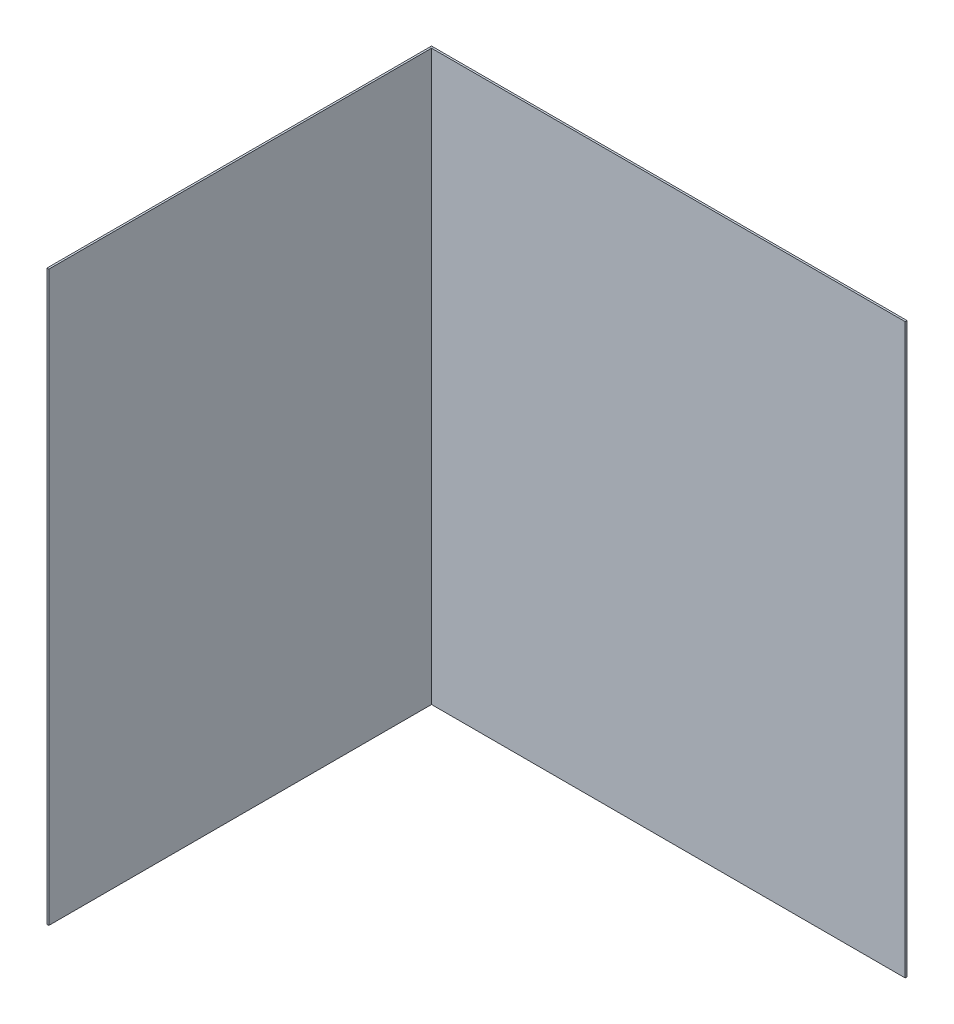
ISO-10303-21;
HEADER;
FILE_DESCRIPTION(('STEP AP214'),'2;1');
FILE_NAME('part.step','',(''),(''),'','','');
FILE_SCHEMA(('AUTOMOTIVE_DESIGN { 1 0 10303 214 1 1 1 1 }'));
ENDSEC;
DATA;
#1=APPLICATION_CONTEXT('core data for automotive mechanical design processes');
#2=APPLICATION_PROTOCOL_DEFINITION('international standard','automotive_design',2000,#1);
#3=PRODUCT_CONTEXT('',#1,'mechanical');
#4=PRODUCT('Part','Part','',(#3));
#5=PRODUCT_RELATED_PRODUCT_CATEGORY('part','',(#4));
#6=PRODUCT_DEFINITION_FORMATION('','',#4);
#7=PRODUCT_DEFINITION_CONTEXT('part definition',#1,'design');
#8=PRODUCT_DEFINITION('design','',#6,#7);
#9=PRODUCT_DEFINITION_SHAPE('','',#8);
#10=(LENGTH_UNIT() NAMED_UNIT(*) SI_UNIT(.MILLI.,.METRE.));
#11=(NAMED_UNIT(*) PLANE_ANGLE_UNIT() SI_UNIT($,.RADIAN.));
#12=(NAMED_UNIT(*) SI_UNIT($,.STERADIAN.) SOLID_ANGLE_UNIT());
#13=UNCERTAINTY_MEASURE_WITH_UNIT(LENGTH_MEASURE(1.E-05),#10,'distance_accuracy_value','');
#14=(GEOMETRIC_REPRESENTATION_CONTEXT(3) GLOBAL_UNCERTAINTY_ASSIGNED_CONTEXT((#13)) GLOBAL_UNIT_ASSIGNED_CONTEXT((#10,
#11,#12)) REPRESENTATION_CONTEXT('',''));
#15=CARTESIAN_POINT('',(0.,0.,0.));
#16=DIRECTION('',(0.,0.,1.));
#17=DIRECTION('',(1.,0.,0.));
#18=AXIS2_PLACEMENT_3D('',#15,#16,#17);
#19=CARTESIAN_POINT('',(-0.001,0.,0.));
#20=DIRECTION('',(1.,0.,0.));
#21=DIRECTION('',(0.,0.,1.));
#22=AXIS2_PLACEMENT_3D('',#19,#20,#21);
#23=PLANE('',#22);
#24=DIRECTION('',(0.,0.,1.));
#25=VECTOR('',#24,1.);
#26=CARTESIAN_POINT('',(-0.001,0.,0.));
#27=LINE('',#26,#25);
#28=CARTESIAN_POINT('',(-0.001,0.,0.001));
#29=VERTEX_POINT('',#28);
#30=CARTESIAN_POINT('',(-0.001,0.,0.203));
#31=VERTEX_POINT('',#30);
#32=EDGE_CURVE('E20',#29,#31,#27,.T.);
#33=ORIENTED_EDGE('',*,*,#32,.T.);
#34=DIRECTION('',(0.,1.,0.));
#35=VECTOR('',#34,1.);
#36=CARTESIAN_POINT('',(-0.001,0.,0.203));
#37=LINE('',#36,#35);
#38=CARTESIAN_POINT('',(-0.001,0.3,0.203));
#39=VERTEX_POINT('',#38);
#40=EDGE_CURVE('E11',#31,#39,#37,.T.);
#41=ORIENTED_EDGE('',*,*,#40,.T.);
#42=DIRECTION('',(0.,0.,-1.));
#43=VECTOR('',#42,1.);
#44=CARTESIAN_POINT('',(-0.001,0.3,0.203));
#45=LINE('',#44,#43);
#46=CARTESIAN_POINT('',(-0.001,0.3,0.001));
#47=VERTEX_POINT('',#46);
#48=EDGE_CURVE('E153',#39,#47,#45,.T.);
#49=ORIENTED_EDGE('',*,*,#48,.T.);
#50=DIRECTION('',(0.,-1.,0.));
#51=VECTOR('',#50,1.);
#52=CARTESIAN_POINT('',(-0.001,0.3,0.001));
#53=LINE('',#52,#51);
#54=EDGE_CURVE('E158',#47,#29,#53,.T.);
#55=ORIENTED_EDGE('',*,*,#54,.T.);
#56=EDGE_LOOP('',(#33,#41,#49,#55));
#57=FACE_BOUND('',#56,.T.);
#58=ADVANCED_FACE('F16',(#57),#23,.F.);
#59=CARTESIAN_POINT('',(0.,0.,0.203));
#60=DIRECTION('',(0.,0.,-1.));
#61=DIRECTION('',(0.,-1.,0.));
#62=AXIS2_PLACEMENT_3D('',#59,#60,#61);
#63=PLANE('',#62);
#64=DIRECTION('',(-1.,0.,0.));
#65=VECTOR('',#64,1.);
#66=CARTESIAN_POINT('',(0.,0.,0.203));
#67=LINE('',#66,#65);
#68=CARTESIAN_POINT('',(0.,0.,0.203));
#69=VERTEX_POINT('',#68);
#70=EDGE_CURVE('E93',#69,#31,#67,.T.);
#71=ORIENTED_EDGE('',*,*,#70,.F.);
#72=DIRECTION('',(0.,1.,0.));
#73=VECTOR('',#72,1.);
#74=CARTESIAN_POINT('',(0.,0.,0.203));
#75=LINE('',#74,#73);
#76=CARTESIAN_POINT('',(0.,0.3,0.203));
#77=VERTEX_POINT('',#76);
#78=EDGE_CURVE('E96',#69,#77,#75,.T.);
#79=ORIENTED_EDGE('',*,*,#78,.T.);
#80=DIRECTION('',(-1.,0.,0.));
#81=VECTOR('',#80,1.);
#82=CARTESIAN_POINT('',(0.,0.3,0.203));
#83=LINE('',#82,#81);
#84=EDGE_CURVE('E27',#77,#39,#83,.T.);
#85=ORIENTED_EDGE('',*,*,#84,.T.);
#86=ORIENTED_EDGE('',*,*,#40,.F.);
#87=EDGE_LOOP('',(#71,#79,#85,#86));
#88=FACE_BOUND('',#87,.T.);
#89=ADVANCED_FACE('F95',(#88),#63,.F.);
#90=CARTESIAN_POINT('',(0.,0.3,0.203));
#91=DIRECTION('',(0.,-1.,0.));
#92=DIRECTION('',(0.,0.,-1.));
#93=AXIS2_PLACEMENT_3D('',#90,#91,#92);
#94=PLANE('',#93);
#95=DIRECTION('',(0.,0.,-1.));
#96=VECTOR('',#95,1.);
#97=CARTESIAN_POINT('',(0.,0.3,0.203));
#98=LINE('',#97,#96);
#99=CARTESIAN_POINT('',(0.,0.3,0.001));
#100=VERTEX_POINT('',#99);
#101=EDGE_CURVE('E109',#77,#100,#98,.T.);
#102=ORIENTED_EDGE('',*,*,#101,.T.);
#103=DIRECTION('',(-1.,0.,0.));
#104=VECTOR('',#103,1.);
#105=CARTESIAN_POINT('',(0.25,0.3,0.001));
#106=LINE('',#105,#104);
#107=EDGE_CURVE('E124',#100,#47,#106,.T.);
#108=ORIENTED_EDGE('',*,*,#107,.T.);
#109=ORIENTED_EDGE('',*,*,#48,.F.);
#110=ORIENTED_EDGE('',*,*,#84,.F.);
#111=EDGE_LOOP('',(#102,#108,#109,#110));
#112=FACE_BOUND('',#111,.T.);
#113=ADVANCED_FACE('F256',(#112),#94,.F.);
#114=CARTESIAN_POINT('',(-0.001,0.3,0.));
#115=DIRECTION('',(1.,0.,0.));
#116=DIRECTION('',(0.,1.,0.));
#117=AXIS2_PLACEMENT_3D('',#114,#115,#116);
#118=PLANE('',#117);
#119=DIRECTION('',(0.,0.,1.));
#120=VECTOR('',#119,1.);
#121=CARTESIAN_POINT('',(-0.001,0.3,0.));
#122=LINE('',#121,#120);
#123=CARTESIAN_POINT('',(-0.001,0.3,0.));
#124=VERTEX_POINT('',#123);
#125=EDGE_CURVE('E146',#124,#47,#122,.T.);
#126=ORIENTED_EDGE('',*,*,#125,.F.);
#127=DIRECTION('',(0.,-1.,0.));
#128=VECTOR('',#127,1.);
#129=CARTESIAN_POINT('',(-0.001,0.3,0.));
#130=LINE('',#129,#128);
#131=CARTESIAN_POINT('',(-0.001,0.,0.));
#132=VERTEX_POINT('',#131);
#133=EDGE_CURVE('E53',#124,#132,#130,.T.);
#134=ORIENTED_EDGE('',*,*,#133,.T.);
#135=DIRECTION('',(0.,0.,1.));
#136=VECTOR('',#135,1.);
#137=CARTESIAN_POINT('',(-0.001,0.,0.));
#138=LINE('',#137,#136);
#139=EDGE_CURVE('E143',#132,#29,#138,.T.);
#140=ORIENTED_EDGE('',*,*,#139,.T.);
#141=ORIENTED_EDGE('',*,*,#54,.F.);
#142=EDGE_LOOP('',(#126,#134,#140,#141));
#143=FACE_BOUND('',#142,.T.);
#144=ADVANCED_FACE('F336',(#143),#118,.F.);
#145=CARTESIAN_POINT('',(0.,0.,0.));
#146=DIRECTION('',(0.,1.,0.));
#147=DIRECTION('',(1.,0.,0.));
#148=AXIS2_PLACEMENT_3D('',#145,#146,#147);
#149=PLANE('',#148);
#150=DIRECTION('',(0.,0.,1.));
#151=VECTOR('',#150,1.);
#152=CARTESIAN_POINT('',(0.,0.,0.));
#153=LINE('',#152,#151);
#154=CARTESIAN_POINT('',(0.,0.,0.001));
#155=VERTEX_POINT('',#154);
#156=EDGE_CURVE('E106',#155,#69,#153,.T.);
#157=ORIENTED_EDGE('',*,*,#156,.T.);
#158=ORIENTED_EDGE('',*,*,#70,.T.);
#159=ORIENTED_EDGE('',*,*,#32,.F.);
#160=DIRECTION('',(1.,0.,0.));
#161=VECTOR('',#160,1.);
#162=CARTESIAN_POINT('',(-0.001,0.,0.001));
#163=LINE('',#162,#161);
#164=EDGE_CURVE('E114',#29,#155,#163,.T.);
#165=ORIENTED_EDGE('',*,*,#164,.T.);
#166=EDGE_LOOP('',(#157,#158,#159,#165));
#167=FACE_BOUND('',#166,.T.);
#168=ADVANCED_FACE('F112',(#167),#149,.F.);
#169=CARTESIAN_POINT('',(0.,0.,0.));
#170=DIRECTION('',(1.,0.,0.));
#171=DIRECTION('',(0.,0.,1.));
#172=AXIS2_PLACEMENT_3D('',#169,#170,#171);
#173=PLANE('',#172);
#174=ORIENTED_EDGE('',*,*,#156,.F.);
#175=DIRECTION('',(0.,-1.,0.));
#176=VECTOR('',#175,1.);
#177=CARTESIAN_POINT('',(0.,0.,0.001));
#178=LINE('',#177,#176);
#179=EDGE_CURVE('E127',#100,#155,#178,.T.);
#180=ORIENTED_EDGE('',*,*,#179,.F.);
#181=ORIENTED_EDGE('',*,*,#101,.F.);
#182=ORIENTED_EDGE('',*,*,#78,.F.);
#183=EDGE_LOOP('',(#174,#180,#181,#182));
#184=FACE_BOUND('',#183,.T.);
#185=ADVANCED_FACE('F104',(#184),#173,.T.);
#186=CARTESIAN_POINT('',(-0.001,0.,0.));
#187=DIRECTION('',(0.,0.,-1.));
#188=DIRECTION('',(0.,-1.,0.));
#189=AXIS2_PLACEMENT_3D('',#186,#187,#188);
#190=PLANE('',#189);
#191=DIRECTION('',(0.,-1.,0.));
#192=VECTOR('',#191,1.);
#193=CARTESIAN_POINT('',(0.,0.3,0.));
#194=LINE('',#193,#192);
#195=CARTESIAN_POINT('',(0.,0.3,0.));
#196=VERTEX_POINT('',#195);
#197=CARTESIAN_POINT('',(0.,0.,0.));
#198=VERTEX_POINT('',#197);
#199=EDGE_CURVE('E168',#196,#198,#194,.T.);
#200=ORIENTED_EDGE('',*,*,#199,.T.);
#201=DIRECTION('',(-1.,0.,0.));
#202=VECTOR('',#201,1.);
#203=CARTESIAN_POINT('',(0.,0.,0.));
#204=LINE('',#203,#202);
#205=EDGE_CURVE('E151',#198,#132,#204,.T.);
#206=ORIENTED_EDGE('',*,*,#205,.T.);
#207=ORIENTED_EDGE('',*,*,#133,.F.);
#208=DIRECTION('',(-1.,0.,0.));
#209=VECTOR('',#208,1.);
#210=CARTESIAN_POINT('',(0.,0.3,0.));
#211=LINE('',#210,#209);
#212=EDGE_CURVE('E148',#196,#124,#211,.T.);
#213=ORIENTED_EDGE('',*,*,#212,.F.);
#214=EDGE_LOOP('',(#200,#206,#207,#213));
#215=FACE_BOUND('',#214,.T.);
#216=ADVANCED_FACE('F237',(#215),#190,.T.);
#217=CARTESIAN_POINT('',(0.,0.3,0.203));
#218=DIRECTION('',(0.,-1.,0.));
#219=DIRECTION('',(0.,0.,-1.));
#220=AXIS2_PLACEMENT_3D('',#217,#218,#219);
#221=PLANE('',#220);
#222=DIRECTION('',(0.,0.,-1.));
#223=VECTOR('',#222,1.);
#224=CARTESIAN_POINT('',(0.,0.3,0.203));
#225=LINE('',#224,#223);
#226=EDGE_CURVE('E129',#100,#196,#225,.T.);
#227=ORIENTED_EDGE('',*,*,#226,.T.);
#228=ORIENTED_EDGE('',*,*,#212,.T.);
#229=ORIENTED_EDGE('',*,*,#125,.T.);
#230=ORIENTED_EDGE('',*,*,#107,.F.);
#231=EDGE_LOOP('',(#227,#228,#229,#230));
#232=FACE_BOUND('',#231,.T.);
#233=ADVANCED_FACE('F298',(#232),#221,.F.);
#234=CARTESIAN_POINT('',(0.,0.,0.));
#235=DIRECTION('',(0.,1.,0.));
#236=DIRECTION('',(1.,0.,0.));
#237=AXIS2_PLACEMENT_3D('',#234,#235,#236);
#238=PLANE('',#237);
#239=DIRECTION('',(0.,0.,1.));
#240=VECTOR('',#239,1.);
#241=CARTESIAN_POINT('',(0.,0.,0.));
#242=LINE('',#241,#240);
#243=EDGE_CURVE('E172',#198,#155,#242,.T.);
#244=ORIENTED_EDGE('',*,*,#243,.T.);
#245=ORIENTED_EDGE('',*,*,#164,.F.);
#246=ORIENTED_EDGE('',*,*,#139,.F.);
#247=ORIENTED_EDGE('',*,*,#205,.F.);
#248=EDGE_LOOP('',(#244,#245,#246,#247));
#249=FACE_BOUND('',#248,.T.);
#250=ADVANCED_FACE('F236',(#249),#238,.F.);
#251=CARTESIAN_POINT('',(-0.001,0.,0.001));
#252=DIRECTION('',(0.,0.,-1.));
#253=DIRECTION('',(0.,-1.,0.));
#254=AXIS2_PLACEMENT_3D('',#251,#252,#253);
#255=PLANE('',#254);
#256=DIRECTION('',(1.,0.,0.));
#257=VECTOR('',#256,1.);
#258=CARTESIAN_POINT('',(-0.001,0.,0.001));
#259=LINE('',#258,#257);
#260=CARTESIAN_POINT('',(0.25,0.,0.001));
#261=VERTEX_POINT('',#260);
#262=EDGE_CURVE('E175',#155,#261,#259,.T.);
#263=ORIENTED_EDGE('',*,*,#262,.T.);
#264=DIRECTION('',(0.,1.,0.));
#265=VECTOR('',#264,1.);
#266=CARTESIAN_POINT('',(0.25,0.,0.001));
#267=LINE('',#266,#265);
#268=CARTESIAN_POINT('',(0.25,0.3,0.001));
#269=VERTEX_POINT('',#268);
#270=EDGE_CURVE('E139',#261,#269,#267,.T.);
#271=ORIENTED_EDGE('',*,*,#270,.T.);
#272=DIRECTION('',(-1.,0.,0.));
#273=VECTOR('',#272,1.);
#274=CARTESIAN_POINT('',(0.25,0.3,0.001));
#275=LINE('',#274,#273);
#276=EDGE_CURVE('E133',#269,#100,#275,.T.);
#277=ORIENTED_EDGE('',*,*,#276,.T.);
#278=ORIENTED_EDGE('',*,*,#179,.T.);
#279=EDGE_LOOP('',(#263,#271,#277,#278));
#280=FACE_BOUND('',#279,.T.);
#281=ADVANCED_FACE('F214',(#280),#255,.F.);
#282=CARTESIAN_POINT('',(-0.001,0.,0.));
#283=DIRECTION('',(0.,0.,-1.));
#284=DIRECTION('',(0.,-1.,0.));
#285=AXIS2_PLACEMENT_3D('',#282,#283,#284);
#286=PLANE('',#285);
#287=DIRECTION('',(1.,0.,0.));
#288=VECTOR('',#287,1.);
#289=CARTESIAN_POINT('',(-0.001,0.,0.));
#290=LINE('',#289,#288);
#291=CARTESIAN_POINT('',(0.25,0.,0.));
#292=VERTEX_POINT('',#291);
#293=EDGE_CURVE('E185',#198,#292,#290,.T.);
#294=ORIENTED_EDGE('',*,*,#293,.F.);
#295=ORIENTED_EDGE('',*,*,#199,.F.);
#296=DIRECTION('',(-1.,0.,0.));
#297=VECTOR('',#296,1.);
#298=CARTESIAN_POINT('',(0.25,0.3,0.));
#299=LINE('',#298,#297);
#300=CARTESIAN_POINT('',(0.25,0.3,0.));
#301=VERTEX_POINT('',#300);
#302=EDGE_CURVE('E134',#301,#196,#299,.T.);
#303=ORIENTED_EDGE('',*,*,#302,.F.);
#304=DIRECTION('',(0.,1.,0.));
#305=VECTOR('',#304,1.);
#306=CARTESIAN_POINT('',(0.25,0.,0.));
#307=LINE('',#306,#305);
#308=EDGE_CURVE('E140',#292,#301,#307,.T.);
#309=ORIENTED_EDGE('',*,*,#308,.F.);
#310=EDGE_LOOP('',(#294,#295,#303,#309));
#311=FACE_BOUND('',#310,.T.);
#312=ADVANCED_FACE('F241',(#311),#286,.T.);
#313=CARTESIAN_POINT('',(0.25,0.3,0.));
#314=DIRECTION('',(0.,-1.,0.));
#315=DIRECTION('',(0.,0.,-1.));
#316=AXIS2_PLACEMENT_3D('',#313,#314,#315);
#317=PLANE('',#316);
#318=ORIENTED_EDGE('',*,*,#302,.T.);
#319=ORIENTED_EDGE('',*,*,#226,.F.);
#320=ORIENTED_EDGE('',*,*,#276,.F.);
#321=DIRECTION('',(0.,0.,1.));
#322=VECTOR('',#321,1.);
#323=CARTESIAN_POINT('',(0.25,0.3,0.));
#324=LINE('',#323,#322);
#325=EDGE_CURVE('E135',#301,#269,#324,.T.);
#326=ORIENTED_EDGE('',*,*,#325,.F.);
#327=EDGE_LOOP('',(#318,#319,#320,#326));
#328=FACE_BOUND('',#327,.T.);
#329=ADVANCED_FACE('F18',(#328),#317,.F.);
#330=CARTESIAN_POINT('',(-0.001,0.,0.));
#331=DIRECTION('',(0.,1.,0.));
#332=DIRECTION('',(1.,0.,0.));
#333=AXIS2_PLACEMENT_3D('',#330,#331,#332);
#334=PLANE('',#333);
#335=ORIENTED_EDGE('',*,*,#293,.T.);
#336=DIRECTION('',(0.,0.,1.));
#337=VECTOR('',#336,1.);
#338=CARTESIAN_POINT('',(0.25,0.,0.));
#339=LINE('',#338,#337);
#340=EDGE_CURVE('E200',#292,#261,#339,.T.);
#341=ORIENTED_EDGE('',*,*,#340,.T.);
#342=ORIENTED_EDGE('',*,*,#262,.F.);
#343=ORIENTED_EDGE('',*,*,#243,.F.);
#344=EDGE_LOOP('',(#335,#341,#342,#343));
#345=FACE_BOUND('',#344,.T.);
#346=ADVANCED_FACE('F240',(#345),#334,.F.);
#347=CARTESIAN_POINT('',(0.25,0.,0.));
#348=DIRECTION('',(-1.,0.,0.));
#349=DIRECTION('',(0.,0.,1.));
#350=AXIS2_PLACEMENT_3D('',#347,#348,#349);
#351=PLANE('',#350);
#352=ORIENTED_EDGE('',*,*,#340,.F.);
#353=ORIENTED_EDGE('',*,*,#308,.T.);
#354=ORIENTED_EDGE('',*,*,#325,.T.);
#355=ORIENTED_EDGE('',*,*,#270,.F.);
#356=EDGE_LOOP('',(#352,#353,#354,#355));
#357=FACE_BOUND('',#356,.T.);
#358=ADVANCED_FACE('F222',(#357),#351,.F.);
#359=CLOSED_SHELL('',(#58,#89,#113,#144,#168,#185,#216,#233,#250,#281,#312,#329,#346,#358));
#360=MANIFOLD_SOLID_BREP('B1',#359);
#361=ADVANCED_BREP_SHAPE_REPRESENTATION('',(#18,#360),#14);
#362=SHAPE_DEFINITION_REPRESENTATION(#9,#361);
ENDSEC;
END-ISO-10303-21;
